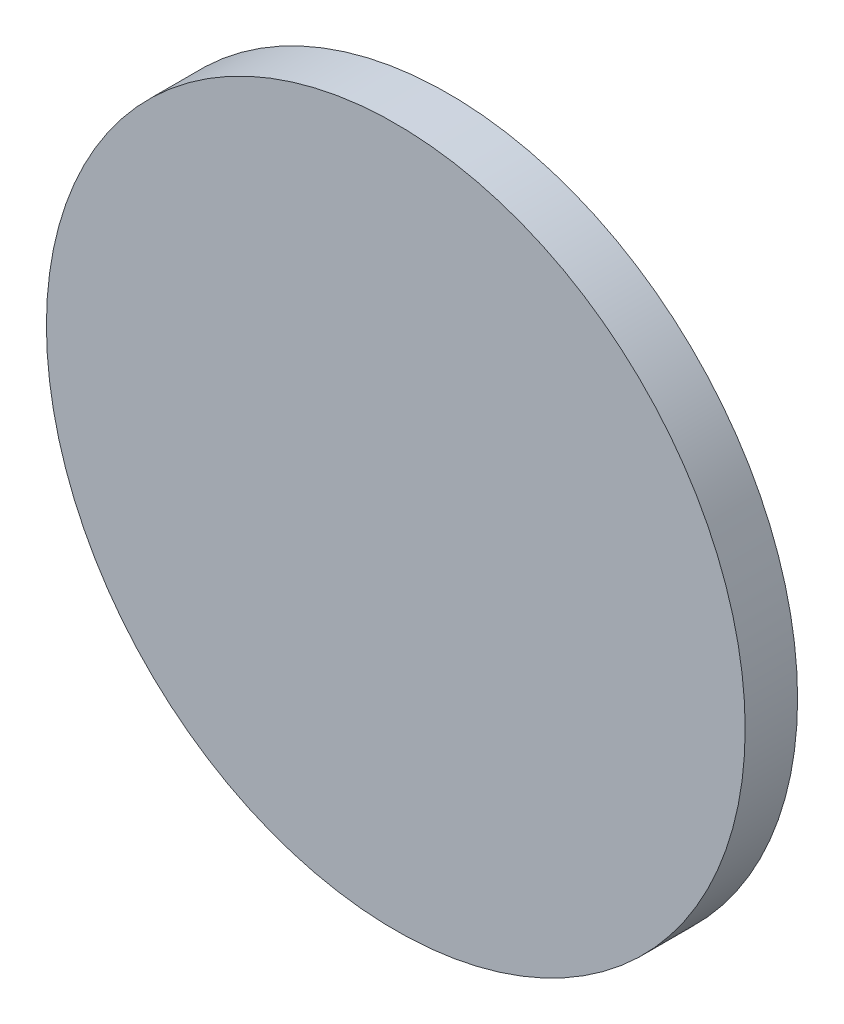
ISO-10303-21;
HEADER;
FILE_DESCRIPTION(('STEP AP214'),'2;1');
FILE_NAME('part.step','',(''),(''),'','','');
FILE_SCHEMA(('AUTOMOTIVE_DESIGN { 1 0 10303 214 1 1 1 1 }'));
ENDSEC;
DATA;
#1=APPLICATION_CONTEXT('core data for automotive mechanical design processes');
#2=APPLICATION_PROTOCOL_DEFINITION('international standard','automotive_design',2000,#1);
#3=PRODUCT_CONTEXT('',#1,'mechanical');
#4=PRODUCT('Part','Part','',(#3));
#5=PRODUCT_RELATED_PRODUCT_CATEGORY('part','',(#4));
#6=PRODUCT_DEFINITION_FORMATION('','',#4);
#7=PRODUCT_DEFINITION_CONTEXT('part definition',#1,'design');
#8=PRODUCT_DEFINITION('design','',#6,#7);
#9=PRODUCT_DEFINITION_SHAPE('','',#8);
#10=(LENGTH_UNIT() NAMED_UNIT(*) SI_UNIT(.MILLI.,.METRE.));
#11=(NAMED_UNIT(*) PLANE_ANGLE_UNIT() SI_UNIT($,.RADIAN.));
#12=(NAMED_UNIT(*) SI_UNIT($,.STERADIAN.) SOLID_ANGLE_UNIT());
#13=UNCERTAINTY_MEASURE_WITH_UNIT(LENGTH_MEASURE(1.E-05),#10,'distance_accuracy_value','');
#14=(GEOMETRIC_REPRESENTATION_CONTEXT(3) GLOBAL_UNCERTAINTY_ASSIGNED_CONTEXT((#13)) GLOBAL_UNIT_ASSIGNED_CONTEXT((#10,
#11,#12)) REPRESENTATION_CONTEXT('',''));
#15=CARTESIAN_POINT('',(0.,0.,0.));
#16=DIRECTION('',(0.,0.,1.));
#17=DIRECTION('',(1.,0.,0.));
#18=AXIS2_PLACEMENT_3D('',#15,#16,#17);
#19=CARTESIAN_POINT('',(12.53916,16.03491,0.));
#20=DIRECTION('',(0.,0.,-1.));
#21=DIRECTION('',(-1.,0.,0.));
#22=AXIS2_PLACEMENT_3D('',#19,#20,#21);
#23=PLANE('',#22);
#24=CARTESIAN_POINT('',(12.53916,16.03491,0.));
#25=DIRECTION('',(0.,0.,1.));
#26=DIRECTION('',(1.,0.,0.));
#27=AXIS2_PLACEMENT_3D('',#24,#25,#26);
#28=CIRCLE('',#27,0.2286);
#29=CARTESIAN_POINT('',(12.76776,16.03491,0.));
#30=VERTEX_POINT('',#29);
#31=EDGE_CURVE('E18',#30,#30,#28,.T.);
#32=ORIENTED_EDGE('',*,*,#31,.F.);
#33=EDGE_LOOP('',(#32));
#34=FACE_BOUND('',#33,.T.);
#35=ADVANCED_FACE('F15',(#34),#23,.T.);
#36=CARTESIAN_POINT('',(12.53916,16.03491,0.));
#37=DIRECTION('',(0.,0.,1.));
#38=DIRECTION('',(1.,0.,0.));
#39=AXIS2_PLACEMENT_3D('',#36,#37,#38);
#40=CYLINDRICAL_SURFACE('',#39,0.2286);
#41=CARTESIAN_POINT('',(12.53916,16.03491,0.03429));
#42=DIRECTION('',(0.,0.,1.));
#43=DIRECTION('',(1.,0.,0.));
#44=AXIS2_PLACEMENT_3D('',#41,#42,#43);
#45=CIRCLE('',#44,0.2286);
#46=CARTESIAN_POINT('',(12.76776,16.03491,0.03429));
#47=VERTEX_POINT('',#46);
#48=EDGE_CURVE('E10',#47,#47,#45,.T.);
#49=ORIENTED_EDGE('',*,*,#48,.F.);
#50=EDGE_LOOP('',(#49));
#51=FACE_BOUND('',#50,.T.);
#52=ORIENTED_EDGE('',*,*,#31,.T.);
#53=EDGE_LOOP('',(#52));
#54=FACE_BOUND('',#53,.T.);
#55=ADVANCED_FACE('F27',(#51,#54),#40,.T.);
#56=CARTESIAN_POINT('',(12.53916,16.03491,0.03429));
#57=DIRECTION('',(0.,0.,1.));
#58=DIRECTION('',(1.,0.,0.));
#59=AXIS2_PLACEMENT_3D('',#56,#57,#58);
#60=PLANE('',#59);
#61=ORIENTED_EDGE('',*,*,#48,.T.);
#62=EDGE_LOOP('',(#61));
#63=FACE_BOUND('',#62,.T.);
#64=ADVANCED_FACE('F34',(#63),#60,.T.);
#65=CLOSED_SHELL('',(#35,#55,#64));
#66=MANIFOLD_SOLID_BREP('B1',#65);
#67=ADVANCED_BREP_SHAPE_REPRESENTATION('',(#18,#66),#14);
#68=SHAPE_DEFINITION_REPRESENTATION(#9,#67);
ENDSEC;
END-ISO-10303-21;
